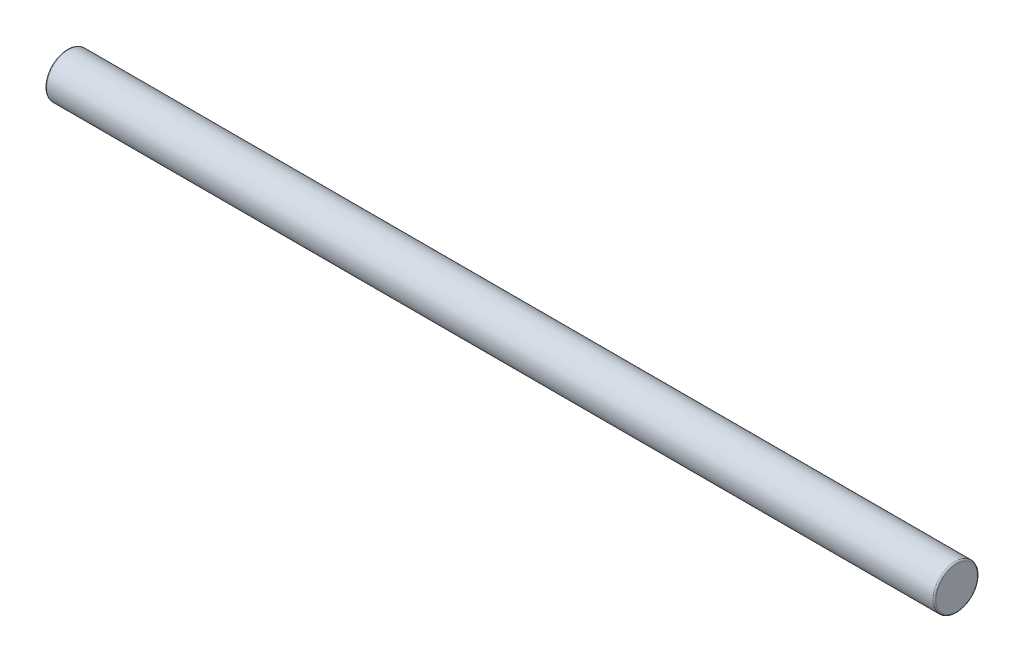
ISO-10303-21;
HEADER;
FILE_DESCRIPTION(('STEP AP214'),'2;1');
FILE_NAME('part.step','',(''),(''),'','','');
FILE_SCHEMA(('AUTOMOTIVE_DESIGN { 1 0 10303 214 1 1 1 1 }'));
ENDSEC;
DATA;
#1=APPLICATION_CONTEXT('core data for automotive mechanical design processes');
#2=APPLICATION_PROTOCOL_DEFINITION('international standard','automotive_design',2000,#1);
#3=PRODUCT_CONTEXT('',#1,'mechanical');
#4=PRODUCT('Part','Part','',(#3));
#5=PRODUCT_RELATED_PRODUCT_CATEGORY('part','',(#4));
#6=PRODUCT_DEFINITION_FORMATION('','',#4);
#7=PRODUCT_DEFINITION_CONTEXT('part definition',#1,'design');
#8=PRODUCT_DEFINITION('design','',#6,#7);
#9=PRODUCT_DEFINITION_SHAPE('','',#8);
#10=(LENGTH_UNIT() NAMED_UNIT(*) SI_UNIT(.MILLI.,.METRE.));
#11=(NAMED_UNIT(*) PLANE_ANGLE_UNIT() SI_UNIT($,.RADIAN.));
#12=(NAMED_UNIT(*) SI_UNIT($,.STERADIAN.) SOLID_ANGLE_UNIT());
#13=UNCERTAINTY_MEASURE_WITH_UNIT(LENGTH_MEASURE(1.E-05),#10,'distance_accuracy_value','');
#14=(GEOMETRIC_REPRESENTATION_CONTEXT(3) GLOBAL_UNCERTAINTY_ASSIGNED_CONTEXT((#13)) GLOBAL_UNIT_ASSIGNED_CONTEXT((#10,
#11,#12)) REPRESENTATION_CONTEXT('',''));
#15=CARTESIAN_POINT('',(0.,0.,0.));
#16=DIRECTION('',(0.,0.,1.));
#17=DIRECTION('',(1.,0.,0.));
#18=AXIS2_PLACEMENT_3D('',#15,#16,#17);
#19=CARTESIAN_POINT('',(15.24,0.,0.));
#20=DIRECTION('',(-1.,0.,0.));
#21=DIRECTION('',(0.,0.,1.));
#22=AXIS2_PLACEMENT_3D('',#19,#20,#21);
#23=CYLINDRICAL_SURFACE('',#22,0.380999999999999);
#24=CARTESIAN_POINT('',(0.0254000000000001,0.,0.));
#25=DIRECTION('',(1.,0.,0.));
#26=DIRECTION('',(0.,0.,-1.));
#27=AXIS2_PLACEMENT_3D('',#24,#25,#26);
#28=CIRCLE('',#27,0.380999999999999);
#29=CARTESIAN_POINT('',(0.0254000000000001,0.,-0.380999999999999));
#30=VERTEX_POINT('',#29);
#31=EDGE_CURVE('E41',#30,#30,#28,.T.);
#32=ORIENTED_EDGE('',*,*,#31,.T.);
#33=EDGE_LOOP('',(#32));
#34=FACE_BOUND('',#33,.T.);
#35=CARTESIAN_POINT('',(15.2146,0.,0.));
#36=DIRECTION('',(1.,0.,0.));
#37=DIRECTION('',(0.,0.,-1.));
#38=AXIS2_PLACEMENT_3D('',#35,#36,#37);
#39=CIRCLE('',#38,0.380999999999999);
#40=CARTESIAN_POINT('',(15.2146,0.,-0.380999999999999));
#41=VERTEX_POINT('',#40);
#42=EDGE_CURVE('E45',#41,#41,#39,.F.);
#43=ORIENTED_EDGE('',*,*,#42,.T.);
#44=EDGE_LOOP('',(#43));
#45=FACE_BOUND('',#44,.T.);
#46=ADVANCED_FACE('F30',(#34,#45),#23,.T.);
#47=CARTESIAN_POINT('',(15.24,0.,0.));
#48=DIRECTION('',(1.,0.,0.));
#49=DIRECTION('',(0.,0.,-1.));
#50=AXIS2_PLACEMENT_3D('',#47,#48,#49);
#51=PLANE('',#50);
#52=CARTESIAN_POINT('',(15.24,0.,0.));
#53=DIRECTION('',(1.,0.,0.));
#54=DIRECTION('',(0.,0.,-1.));
#55=AXIS2_PLACEMENT_3D('',#52,#53,#54);
#56=CIRCLE('',#55,0.355599999999999);
#57=CARTESIAN_POINT('',(15.24,0.,-0.355599999999999));
#58=VERTEX_POINT('',#57);
#59=EDGE_CURVE('E10',#58,#58,#56,.T.);
#60=ORIENTED_EDGE('',*,*,#59,.T.);
#61=EDGE_LOOP('',(#60));
#62=FACE_BOUND('',#61,.T.);
#63=ADVANCED_FACE('F61',(#62),#51,.T.);
#64=CARTESIAN_POINT('',(0.,0.,0.));
#65=DIRECTION('',(1.,0.,0.));
#66=DIRECTION('',(0.,0.,-1.));
#67=AXIS2_PLACEMENT_3D('',#64,#65,#66);
#68=PLANE('',#67);
#69=CARTESIAN_POINT('',(0.,0.,0.));
#70=DIRECTION('',(1.,0.,0.));
#71=DIRECTION('',(0.,0.,-1.));
#72=AXIS2_PLACEMENT_3D('',#69,#70,#71);
#73=CIRCLE('',#72,0.355599999999999);
#74=CARTESIAN_POINT('',(0.,0.,-0.355599999999999));
#75=VERTEX_POINT('',#74);
#76=EDGE_CURVE('E37',#75,#75,#73,.F.);
#77=ORIENTED_EDGE('',*,*,#76,.T.);
#78=EDGE_LOOP('',(#77));
#79=FACE_BOUND('',#78,.T.);
#80=ADVANCED_FACE('F58',(#79),#68,.F.);
#81=CARTESIAN_POINT('',(0.0254000000000001,0.,0.));
#82=DIRECTION('',(1.,0.,0.));
#83=DIRECTION('',(0.,0.,-1.));
#84=AXIS2_PLACEMENT_3D('',#81,#82,#83);
#85=TOROIDAL_SURFACE('',#84,0.355599999999999,0.0254);
#86=ORIENTED_EDGE('',*,*,#76,.F.);
#87=EDGE_LOOP('',(#86));
#88=FACE_BOUND('',#87,.T.);
#89=ORIENTED_EDGE('',*,*,#31,.F.);
#90=EDGE_LOOP('',(#89));
#91=FACE_BOUND('',#90,.T.);
#92=ADVANCED_FACE('F54',(#88,#91),#85,.T.);
#93=CARTESIAN_POINT('',(15.2146,0.,0.));
#94=DIRECTION('',(1.,0.,0.));
#95=DIRECTION('',(0.,0.,-1.));
#96=AXIS2_PLACEMENT_3D('',#93,#94,#95);
#97=TOROIDAL_SURFACE('',#96,0.355599999999999,0.0254);
#98=ORIENTED_EDGE('',*,*,#42,.F.);
#99=EDGE_LOOP('',(#98));
#100=FACE_BOUND('',#99,.T.);
#101=ORIENTED_EDGE('',*,*,#59,.F.);
#102=EDGE_LOOP('',(#101));
#103=FACE_BOUND('',#102,.T.);
#104=ADVANCED_FACE('F32',(#100,#103),#97,.T.);
#105=CLOSED_SHELL('',(#46,#63,#80,#92,#104));
#106=MANIFOLD_SOLID_BREP('B2',#105);
#107=ADVANCED_BREP_SHAPE_REPRESENTATION('',(#18,#106),#14);
#108=SHAPE_DEFINITION_REPRESENTATION(#9,#107);
ENDSEC;
END-ISO-10303-21;
